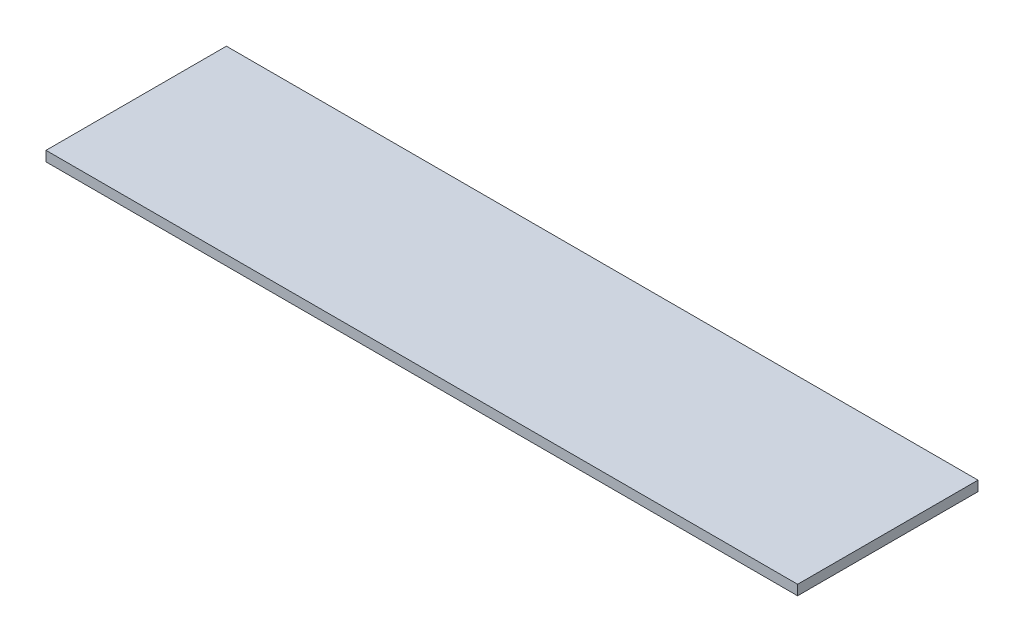
ISO-10303-21;
HEADER;
FILE_DESCRIPTION(('STEP AP214'),'2;1');
FILE_NAME('part.step','',(''),(''),'','','');
FILE_SCHEMA(('AUTOMOTIVE_DESIGN { 1 0 10303 214 1 1 1 1 }'));
ENDSEC;
DATA;
#1=APPLICATION_CONTEXT('core data for automotive mechanical design processes');
#2=APPLICATION_PROTOCOL_DEFINITION('international standard','automotive_design',2000,#1);
#3=PRODUCT_CONTEXT('',#1,'mechanical');
#4=PRODUCT('Part','Part','',(#3));
#5=PRODUCT_RELATED_PRODUCT_CATEGORY('part','',(#4));
#6=PRODUCT_DEFINITION_FORMATION('','',#4);
#7=PRODUCT_DEFINITION_CONTEXT('part definition',#1,'design');
#8=PRODUCT_DEFINITION('design','',#6,#7);
#9=PRODUCT_DEFINITION_SHAPE('','',#8);
#10=(LENGTH_UNIT() NAMED_UNIT(*) SI_UNIT(.MILLI.,.METRE.));
#11=(NAMED_UNIT(*) PLANE_ANGLE_UNIT() SI_UNIT($,.RADIAN.));
#12=(NAMED_UNIT(*) SI_UNIT($,.STERADIAN.) SOLID_ANGLE_UNIT());
#13=UNCERTAINTY_MEASURE_WITH_UNIT(LENGTH_MEASURE(1.E-05),#10,'distance_accuracy_value','');
#14=(GEOMETRIC_REPRESENTATION_CONTEXT(3) GLOBAL_UNCERTAINTY_ASSIGNED_CONTEXT((#13)) GLOBAL_UNIT_ASSIGNED_CONTEXT((#10,
#11,#12)) REPRESENTATION_CONTEXT('',''));
#15=CARTESIAN_POINT('',(0.,0.,0.));
#16=DIRECTION('',(0.,0.,1.));
#17=DIRECTION('',(1.,0.,0.));
#18=AXIS2_PLACEMENT_3D('',#15,#16,#17);
#19=CARTESIAN_POINT('',(75.,-2.,18.));
#20=DIRECTION('',(0.,1.,0.));
#21=DIRECTION('',(0.,0.,1.));
#22=AXIS2_PLACEMENT_3D('',#19,#20,#21);
#23=PLANE('',#22);
#24=DIRECTION('',(0.,0.,-1.));
#25=VECTOR('',#24,1.);
#26=CARTESIAN_POINT('',(-75.,-2.,18.));
#27=LINE('',#26,#25);
#28=CARTESIAN_POINT('',(-75.,-2.,18.));
#29=VERTEX_POINT('',#28);
#30=CARTESIAN_POINT('',(-75.,-2.,-18.));
#31=VERTEX_POINT('',#30);
#32=EDGE_CURVE('E98',#29,#31,#27,.T.);
#33=ORIENTED_EDGE('',*,*,#32,.T.);
#34=DIRECTION('',(-1.,0.,0.));
#35=VECTOR('',#34,1.);
#36=CARTESIAN_POINT('',(75.,-2.,-18.));
#37=LINE('',#36,#35);
#38=CARTESIAN_POINT('',(75.,-2.,-18.));
#39=VERTEX_POINT('',#38);
#40=EDGE_CURVE('E11',#39,#31,#37,.T.);
#41=ORIENTED_EDGE('',*,*,#40,.F.);
#42=DIRECTION('',(0.,0.,-1.));
#43=VECTOR('',#42,1.);
#44=CARTESIAN_POINT('',(75.,-2.,18.));
#45=LINE('',#44,#43);
#46=CARTESIAN_POINT('',(75.,-2.,18.));
#47=VERTEX_POINT('',#46);
#48=EDGE_CURVE('E75',#47,#39,#45,.T.);
#49=ORIENTED_EDGE('',*,*,#48,.F.);
#50=DIRECTION('',(-1.,0.,0.));
#51=VECTOR('',#50,1.);
#52=CARTESIAN_POINT('',(75.,-2.,18.));
#53=LINE('',#52,#51);
#54=EDGE_CURVE('E51',#47,#29,#53,.T.);
#55=ORIENTED_EDGE('',*,*,#54,.T.);
#56=EDGE_LOOP('',(#33,#41,#49,#55));
#57=FACE_BOUND('',#56,.T.);
#58=ADVANCED_FACE('F35',(#57),#23,.F.);
#59=CARTESIAN_POINT('',(75.,0.,-18.));
#60=DIRECTION('',(0.,0.,-1.));
#61=DIRECTION('',(-1.,0.,0.));
#62=AXIS2_PLACEMENT_3D('',#59,#60,#61);
#63=PLANE('',#62);
#64=DIRECTION('',(0.,-1.,0.));
#65=VECTOR('',#64,1.);
#66=CARTESIAN_POINT('',(-75.,0.,-18.));
#67=LINE('',#66,#65);
#68=CARTESIAN_POINT('',(-75.,0.,-18.));
#69=VERTEX_POINT('',#68);
#70=EDGE_CURVE('E84',#69,#31,#67,.T.);
#71=ORIENTED_EDGE('',*,*,#70,.F.);
#72=DIRECTION('',(-1.,0.,0.));
#73=VECTOR('',#72,1.);
#74=CARTESIAN_POINT('',(75.,0.,-18.));
#75=LINE('',#74,#73);
#76=CARTESIAN_POINT('',(75.,0.,-18.));
#77=VERTEX_POINT('',#76);
#78=EDGE_CURVE('E43',#77,#69,#75,.T.);
#79=ORIENTED_EDGE('',*,*,#78,.F.);
#80=DIRECTION('',(0.,-1.,0.));
#81=VECTOR('',#80,1.);
#82=CARTESIAN_POINT('',(75.,0.,-18.));
#83=LINE('',#82,#81);
#84=EDGE_CURVE('E82',#77,#39,#83,.T.);
#85=ORIENTED_EDGE('',*,*,#84,.T.);
#86=ORIENTED_EDGE('',*,*,#40,.T.);
#87=EDGE_LOOP('',(#71,#79,#85,#86));
#88=FACE_BOUND('',#87,.T.);
#89=ADVANCED_FACE('F81',(#88),#63,.T.);
#90=CARTESIAN_POINT('',(75.,0.,18.));
#91=DIRECTION('',(0.,1.,0.));
#92=DIRECTION('',(0.,0.,1.));
#93=AXIS2_PLACEMENT_3D('',#90,#91,#92);
#94=PLANE('',#93);
#95=DIRECTION('',(0.,0.,-1.));
#96=VECTOR('',#95,1.);
#97=CARTESIAN_POINT('',(-75.,0.,18.));
#98=LINE('',#97,#96);
#99=CARTESIAN_POINT('',(-75.,0.,18.));
#100=VERTEX_POINT('',#99);
#101=EDGE_CURVE('E101',#100,#69,#98,.T.);
#102=ORIENTED_EDGE('',*,*,#101,.F.);
#103=DIRECTION('',(-1.,0.,0.));
#104=VECTOR('',#103,1.);
#105=CARTESIAN_POINT('',(75.,0.,18.));
#106=LINE('',#105,#104);
#107=CARTESIAN_POINT('',(75.,0.,18.));
#108=VERTEX_POINT('',#107);
#109=EDGE_CURVE('E64',#108,#100,#106,.T.);
#110=ORIENTED_EDGE('',*,*,#109,.F.);
#111=DIRECTION('',(0.,0.,-1.));
#112=VECTOR('',#111,1.);
#113=CARTESIAN_POINT('',(75.,0.,18.));
#114=LINE('',#113,#112);
#115=EDGE_CURVE('E90',#108,#77,#114,.T.);
#116=ORIENTED_EDGE('',*,*,#115,.T.);
#117=ORIENTED_EDGE('',*,*,#78,.T.);
#118=EDGE_LOOP('',(#102,#110,#116,#117));
#119=FACE_BOUND('',#118,.T.);
#120=ADVANCED_FACE('F92',(#119),#94,.T.);
#121=CARTESIAN_POINT('',(75.,-2.,18.));
#122=DIRECTION('',(0.,0.,1.));
#123=DIRECTION('',(1.,0.,0.));
#124=AXIS2_PLACEMENT_3D('',#121,#122,#123);
#125=PLANE('',#124);
#126=DIRECTION('',(0.,1.,0.));
#127=VECTOR('',#126,1.);
#128=CARTESIAN_POINT('',(-75.,-2.,18.));
#129=LINE('',#128,#127);
#130=EDGE_CURVE('E103',#29,#100,#129,.T.);
#131=ORIENTED_EDGE('',*,*,#130,.F.);
#132=ORIENTED_EDGE('',*,*,#54,.F.);
#133=DIRECTION('',(0.,1.,0.));
#134=VECTOR('',#133,1.);
#135=CARTESIAN_POINT('',(75.,-2.,18.));
#136=LINE('',#135,#134);
#137=EDGE_CURVE('E93',#47,#108,#136,.T.);
#138=ORIENTED_EDGE('',*,*,#137,.T.);
#139=ORIENTED_EDGE('',*,*,#109,.T.);
#140=EDGE_LOOP('',(#131,#132,#138,#139));
#141=FACE_BOUND('',#140,.T.);
#142=ADVANCED_FACE('F109',(#141),#125,.T.);
#143=CARTESIAN_POINT('',(75.,-2.,-18.));
#144=DIRECTION('',(-1.,0.,0.));
#145=DIRECTION('',(0.,0.,1.));
#146=AXIS2_PLACEMENT_3D('',#143,#144,#145);
#147=PLANE('',#146);
#148=ORIENTED_EDGE('',*,*,#48,.T.);
#149=ORIENTED_EDGE('',*,*,#84,.F.);
#150=ORIENTED_EDGE('',*,*,#115,.F.);
#151=ORIENTED_EDGE('',*,*,#137,.F.);
#152=EDGE_LOOP('',(#148,#149,#150,#151));
#153=FACE_BOUND('',#152,.T.);
#154=ADVANCED_FACE('F89',(#153),#147,.F.);
#155=CARTESIAN_POINT('',(-75.,-2.,-18.));
#156=DIRECTION('',(-1.,0.,0.));
#157=DIRECTION('',(0.,0.,1.));
#158=AXIS2_PLACEMENT_3D('',#155,#156,#157);
#159=PLANE('',#158);
#160=ORIENTED_EDGE('',*,*,#32,.F.);
#161=ORIENTED_EDGE('',*,*,#130,.T.);
#162=ORIENTED_EDGE('',*,*,#101,.T.);
#163=ORIENTED_EDGE('',*,*,#70,.T.);
#164=EDGE_LOOP('',(#160,#161,#162,#163));
#165=FACE_BOUND('',#164,.T.);
#166=ADVANCED_FACE('F108',(#165),#159,.T.);
#167=CLOSED_SHELL('',(#58,#89,#120,#142,#154,#166));
#168=MANIFOLD_SOLID_BREP('B2',#167);
#169=ADVANCED_BREP_SHAPE_REPRESENTATION('',(#18,#168),#14);
#170=SHAPE_DEFINITION_REPRESENTATION(#9,#169);
ENDSEC;
END-ISO-10303-21;
